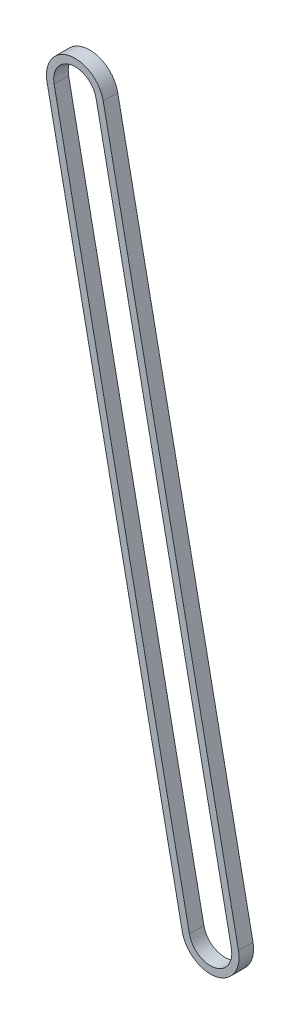
ISO-10303-21;
HEADER;
FILE_DESCRIPTION(('STEP AP214'),'2;1');
FILE_NAME('part.step','',(''),(''),'','','');
FILE_SCHEMA(('AUTOMOTIVE_DESIGN { 1 0 10303 214 1 1 1 1 }'));
ENDSEC;
DATA;
#1=APPLICATION_CONTEXT('core data for automotive mechanical design processes');
#2=APPLICATION_PROTOCOL_DEFINITION('international standard','automotive_design',2000,#1);
#3=PRODUCT_CONTEXT('',#1,'mechanical');
#4=PRODUCT('Part','Part','',(#3));
#5=PRODUCT_RELATED_PRODUCT_CATEGORY('part','',(#4));
#6=PRODUCT_DEFINITION_FORMATION('','',#4);
#7=PRODUCT_DEFINITION_CONTEXT('part definition',#1,'design');
#8=PRODUCT_DEFINITION('design','',#6,#7);
#9=PRODUCT_DEFINITION_SHAPE('','',#8);
#10=(LENGTH_UNIT() NAMED_UNIT(*) SI_UNIT(.MILLI.,.METRE.));
#11=(NAMED_UNIT(*) PLANE_ANGLE_UNIT() SI_UNIT($,.RADIAN.));
#12=(NAMED_UNIT(*) SI_UNIT($,.STERADIAN.) SOLID_ANGLE_UNIT());
#13=UNCERTAINTY_MEASURE_WITH_UNIT(LENGTH_MEASURE(1.E-05),#10,'distance_accuracy_value','');
#14=(GEOMETRIC_REPRESENTATION_CONTEXT(3) GLOBAL_UNCERTAINTY_ASSIGNED_CONTEXT((#13)) GLOBAL_UNIT_ASSIGNED_CONTEXT((#10,
#11,#12)) REPRESENTATION_CONTEXT('',''));
#15=CARTESIAN_POINT('',(0.,0.,0.));
#16=DIRECTION('',(0.,0.,1.));
#17=DIRECTION('',(1.,0.,0.));
#18=AXIS2_PLACEMENT_3D('',#15,#16,#17);
#19=CARTESIAN_POINT('',(0.,0.,4.));
#20=DIRECTION('',(0.,0.,-1.));
#21=DIRECTION('',(-1.,0.,0.));
#22=AXIS2_PLACEMENT_3D('',#19,#20,#21);
#23=CYLINDRICAL_SURFACE('',#22,7.9);
#24=CARTESIAN_POINT('',(0.,0.,0.));
#25=DIRECTION('',(0.,0.,1.));
#26=DIRECTION('',(1.,0.,0.));
#27=AXIS2_PLACEMENT_3D('',#24,#25,#26);
#28=CIRCLE('',#27,7.9);
#29=CARTESIAN_POINT('',(7.74297477721074,1.5672720247227,0.));
#30=VERTEX_POINT('',#29);
#31=CARTESIAN_POINT('',(-7.74297477721074,-1.56727202472271,0.));
#32=VERTEX_POINT('',#31);
#33=EDGE_CURVE('E132',#30,#32,#28,.T.);
#34=ORIENTED_EDGE('',*,*,#33,.T.);
#35=DIRECTION('',(0.,0.,-1.));
#36=VECTOR('',#35,1.);
#37=CARTESIAN_POINT('',(-7.74297477721074,-1.56727202472271,4.));
#38=LINE('',#37,#36);
#39=CARTESIAN_POINT('',(-7.74297477721074,-1.56727202472271,4.));
#40=VERTEX_POINT('',#39);
#41=EDGE_CURVE('E11',#40,#32,#38,.T.);
#42=ORIENTED_EDGE('',*,*,#41,.F.);
#43=CARTESIAN_POINT('',(0.,0.,4.));
#44=DIRECTION('',(0.,0.,1.));
#45=DIRECTION('',(1.,0.,0.));
#46=AXIS2_PLACEMENT_3D('',#43,#44,#45);
#47=CIRCLE('',#46,7.9);
#48=CARTESIAN_POINT('',(7.74297477721074,1.5672720247227,4.));
#49=VERTEX_POINT('',#48);
#50=EDGE_CURVE('E136',#49,#40,#47,.T.);
#51=ORIENTED_EDGE('',*,*,#50,.F.);
#52=DIRECTION('',(0.,0.,-1.));
#53=VECTOR('',#52,1.);
#54=CARTESIAN_POINT('',(7.74297477721074,1.5672720247227,4.));
#55=LINE('',#54,#53);
#56=EDGE_CURVE('E146',#49,#30,#55,.T.);
#57=ORIENTED_EDGE('',*,*,#56,.T.);
#58=EDGE_LOOP('',(#34,#42,#51,#57));
#59=FACE_BOUND('',#58,.T.);
#60=ADVANCED_FACE('F35',(#59),#23,.T.);
#61=CARTESIAN_POINT('',(-7.74297477721074,-1.56727202472271,4.));
#62=DIRECTION('',(0.980123389520346,0.19838886388895,0.));
#63=DIRECTION('',(-0.19838886388895,0.980123389520346,0.));
#64=AXIS2_PLACEMENT_3D('',#61,#62,#63);
#65=PLANE('',#64);
#66=DIRECTION('',(0.19838886388895,-0.980123389520346,0.));
#67=VECTOR('',#66,1.);
#68=CARTESIAN_POINT('',(-7.74297477721074,-1.56727202472271,0.));
#69=LINE('',#68,#67);
#70=CARTESIAN_POINT('',(29.5030484530667,-185.578097123492,0.));
#71=VERTEX_POINT('',#70);
#72=EDGE_CURVE('E149',#32,#71,#69,.T.);
#73=ORIENTED_EDGE('',*,*,#72,.T.);
#74=DIRECTION('',(0.,0.,-1.));
#75=VECTOR('',#74,1.);
#76=CARTESIAN_POINT('',(29.5030484530667,-185.578097123492,4.));
#77=LINE('',#76,#75);
#78=CARTESIAN_POINT('',(29.5030484530667,-185.578097123492,4.));
#79=VERTEX_POINT('',#78);
#80=EDGE_CURVE('E42',#79,#71,#77,.T.);
#81=ORIENTED_EDGE('',*,*,#80,.F.);
#82=DIRECTION('',(0.19838886388895,-0.980123389520346,0.));
#83=VECTOR('',#82,1.);
#84=CARTESIAN_POINT('',(-7.74297477721074,-1.56727202472271,4.));
#85=LINE('',#84,#83);
#86=EDGE_CURVE('E139',#40,#79,#85,.T.);
#87=ORIENTED_EDGE('',*,*,#86,.F.);
#88=ORIENTED_EDGE('',*,*,#41,.T.);
#89=EDGE_LOOP('',(#73,#81,#87,#88));
#90=FACE_BOUND('',#89,.T.);
#91=ADVANCED_FACE('F177',(#90),#65,.F.);
#92=CARTESIAN_POINT('',(37.2460232302775,-184.010825098769,4.));
#93=DIRECTION('',(0.,0.,-1.));
#94=DIRECTION('',(-1.,0.,0.));
#95=AXIS2_PLACEMENT_3D('',#92,#93,#94);
#96=CYLINDRICAL_SURFACE('',#95,7.90000000000001);
#97=CARTESIAN_POINT('',(37.2460232302775,-184.010825098769,0.));
#98=DIRECTION('',(0.,0.,1.));
#99=DIRECTION('',(1.,0.,0.));
#100=AXIS2_PLACEMENT_3D('',#97,#98,#99);
#101=CIRCLE('',#100,7.90000000000001);
#102=CARTESIAN_POINT('',(44.9889980074882,-182.443553074046,0.));
#103=VERTEX_POINT('',#102);
#104=EDGE_CURVE('E151',#71,#103,#101,.T.);
#105=ORIENTED_EDGE('',*,*,#104,.T.);
#106=DIRECTION('',(0.,0.,-1.));
#107=VECTOR('',#106,1.);
#108=CARTESIAN_POINT('',(44.9889980074882,-182.443553074046,4.));
#109=LINE('',#108,#107);
#110=CARTESIAN_POINT('',(44.9889980074882,-182.443553074046,4.));
#111=VERTEX_POINT('',#110);
#112=EDGE_CURVE('E156',#111,#103,#109,.T.);
#113=ORIENTED_EDGE('',*,*,#112,.F.);
#114=CARTESIAN_POINT('',(37.2460232302775,-184.010825098769,4.));
#115=DIRECTION('',(0.,0.,1.));
#116=DIRECTION('',(1.,0.,0.));
#117=AXIS2_PLACEMENT_3D('',#114,#115,#116);
#118=CIRCLE('',#117,7.90000000000001);
#119=EDGE_CURVE('E142',#79,#111,#118,.T.);
#120=ORIENTED_EDGE('',*,*,#119,.F.);
#121=ORIENTED_EDGE('',*,*,#80,.T.);
#122=EDGE_LOOP('',(#105,#113,#120,#121));
#123=FACE_BOUND('',#122,.T.);
#124=ADVANCED_FACE('F163',(#123),#96,.T.);
#125=CARTESIAN_POINT('',(44.9889980074882,-182.443553074046,4.));
#126=DIRECTION('',(-0.980123389520346,-0.19838886388895,0.));
#127=DIRECTION('',(0.19838886388895,-0.980123389520346,0.));
#128=AXIS2_PLACEMENT_3D('',#125,#126,#127);
#129=PLANE('',#128);
#130=DIRECTION('',(-0.19838886388895,0.980123389520346,0.));
#131=VECTOR('',#130,1.);
#132=CARTESIAN_POINT('',(44.9889980074882,-182.443553074046,0.));
#133=LINE('',#132,#131);
#134=EDGE_CURVE('E140',#103,#30,#133,.T.);
#135=ORIENTED_EDGE('',*,*,#134,.T.);
#136=ORIENTED_EDGE('',*,*,#56,.F.);
#137=DIRECTION('',(-0.19838886388895,0.980123389520346,0.));
#138=VECTOR('',#137,1.);
#139=CARTESIAN_POINT('',(44.9889980074882,-182.443553074046,4.));
#140=LINE('',#139,#138);
#141=EDGE_CURVE('E144',#111,#49,#140,.T.);
#142=ORIENTED_EDGE('',*,*,#141,.F.);
#143=ORIENTED_EDGE('',*,*,#112,.T.);
#144=EDGE_LOOP('',(#135,#136,#142,#143));
#145=FACE_BOUND('',#144,.T.);
#146=ADVANCED_FACE('F170',(#145),#129,.F.);
#147=CARTESIAN_POINT('',(0.,0.,4.));
#148=DIRECTION('',(0.,0.,1.));
#149=DIRECTION('',(1.,0.,0.));
#150=AXIS2_PLACEMENT_3D('',#147,#148,#149);
#151=PLANE('',#150);
#152=CARTESIAN_POINT('',(37.2460232302775,-184.010825098769,4.));
#153=DIRECTION('',(0.,0.,1.));
#154=DIRECTION('',(1.,0.,0.));
#155=AXIS2_PLACEMENT_3D('',#152,#153,#154);
#156=CIRCLE('',#155,5.90000000000001);
#157=CARTESIAN_POINT('',(31.4632952321074,-185.181319395714,4.));
#158=VERTEX_POINT('',#157);
#159=CARTESIAN_POINT('',(43.0287512284475,-182.840330801824,4.));
#160=VERTEX_POINT('',#159);
#161=EDGE_CURVE('E49',#158,#160,#156,.T.);
#162=ORIENTED_EDGE('',*,*,#161,.F.);
#163=DIRECTION('',(0.19838886388895,-0.980123389520346,0.));
#164=VECTOR('',#163,1.);
#165=CARTESIAN_POINT('',(-5.78272799817004,-1.17049429694481,4.));
#166=LINE('',#165,#164);
#167=CARTESIAN_POINT('',(-5.78272799817004,-1.17049429694481,4.));
#168=VERTEX_POINT('',#167);
#169=EDGE_CURVE('E117',#168,#158,#166,.T.);
#170=ORIENTED_EDGE('',*,*,#169,.F.);
#171=CARTESIAN_POINT('',(0.,0.,4.));
#172=DIRECTION('',(0.,0.,1.));
#173=DIRECTION('',(1.,0.,0.));
#174=AXIS2_PLACEMENT_3D('',#171,#172,#173);
#175=CIRCLE('',#174,5.9);
#176=CARTESIAN_POINT('',(5.78272799817004,1.17049429694482,4.));
#177=VERTEX_POINT('',#176);
#178=EDGE_CURVE('E120',#177,#168,#175,.T.);
#179=ORIENTED_EDGE('',*,*,#178,.F.);
#180=DIRECTION('',(-0.19838886388895,0.980123389520346,0.));
#181=VECTOR('',#180,1.);
#182=CARTESIAN_POINT('',(43.0287512284475,-182.840330801824,4.));
#183=LINE('',#182,#181);
#184=EDGE_CURVE('E126',#160,#177,#183,.T.);
#185=ORIENTED_EDGE('',*,*,#184,.F.);
#186=EDGE_LOOP('',(#162,#170,#179,#185));
#187=FACE_BOUND('',#186,.T.);
#188=ORIENTED_EDGE('',*,*,#50,.T.);
#189=ORIENTED_EDGE('',*,*,#86,.T.);
#190=ORIENTED_EDGE('',*,*,#119,.T.);
#191=ORIENTED_EDGE('',*,*,#141,.T.);
#192=EDGE_LOOP('',(#188,#189,#190,#191));
#193=FACE_BOUND('',#192,.T.);
#194=ADVANCED_FACE('F176',(#187,#193),#151,.T.);
#195=CARTESIAN_POINT('',(0.,0.,0.));
#196=DIRECTION('',(0.,0.,1.));
#197=DIRECTION('',(1.,0.,0.));
#198=AXIS2_PLACEMENT_3D('',#195,#196,#197);
#199=PLANE('',#198);
#200=DIRECTION('',(0.19838886388895,-0.980123389520346,0.));
#201=VECTOR('',#200,1.);
#202=CARTESIAN_POINT('',(-5.78272799817004,-1.17049429694481,0.));
#203=LINE('',#202,#201);
#204=CARTESIAN_POINT('',(-5.78272799817004,-1.17049429694481,0.));
#205=VERTEX_POINT('',#204);
#206=CARTESIAN_POINT('',(31.4632952321074,-185.181319395714,0.));
#207=VERTEX_POINT('',#206);
#208=EDGE_CURVE('E107',#205,#207,#203,.T.);
#209=ORIENTED_EDGE('',*,*,#208,.T.);
#210=CARTESIAN_POINT('',(37.2460232302775,-184.010825098769,0.));
#211=DIRECTION('',(0.,0.,1.));
#212=DIRECTION('',(1.,0.,0.));
#213=AXIS2_PLACEMENT_3D('',#210,#211,#212);
#214=CIRCLE('',#213,5.90000000000001);
#215=CARTESIAN_POINT('',(43.0287512284475,-182.840330801824,0.));
#216=VERTEX_POINT('',#215);
#217=EDGE_CURVE('E101',#207,#216,#214,.T.);
#218=ORIENTED_EDGE('',*,*,#217,.T.);
#219=DIRECTION('',(-0.19838886388895,0.980123389520346,0.));
#220=VECTOR('',#219,1.);
#221=CARTESIAN_POINT('',(43.0287512284475,-182.840330801824,0.));
#222=LINE('',#221,#220);
#223=CARTESIAN_POINT('',(5.78272799817003,1.17049429694482,0.));
#224=VERTEX_POINT('',#223);
#225=EDGE_CURVE('E110',#216,#224,#222,.T.);
#226=ORIENTED_EDGE('',*,*,#225,.T.);
#227=CARTESIAN_POINT('',(0.,0.,0.));
#228=DIRECTION('',(0.,0.,1.));
#229=DIRECTION('',(1.,0.,0.));
#230=AXIS2_PLACEMENT_3D('',#227,#228,#229);
#231=CIRCLE('',#230,5.9);
#232=EDGE_CURVE('E57',#224,#205,#231,.T.);
#233=ORIENTED_EDGE('',*,*,#232,.T.);
#234=EDGE_LOOP('',(#209,#218,#226,#233));
#235=FACE_BOUND('',#234,.T.);
#236=ORIENTED_EDGE('',*,*,#33,.F.);
#237=ORIENTED_EDGE('',*,*,#134,.F.);
#238=ORIENTED_EDGE('',*,*,#104,.F.);
#239=ORIENTED_EDGE('',*,*,#72,.F.);
#240=EDGE_LOOP('',(#236,#237,#238,#239));
#241=FACE_BOUND('',#240,.T.);
#242=ADVANCED_FACE('F114',(#235,#241),#199,.F.);
#243=CARTESIAN_POINT('',(37.2460232302775,-184.010825098769,0.));
#244=DIRECTION('',(0.,0.,1.));
#245=DIRECTION('',(1.,0.,0.));
#246=AXIS2_PLACEMENT_3D('',#243,#244,#245);
#247=CYLINDRICAL_SURFACE('',#246,5.90000000000001);
#248=ORIENTED_EDGE('',*,*,#161,.T.);
#249=DIRECTION('',(0.,0.,1.));
#250=VECTOR('',#249,1.);
#251=CARTESIAN_POINT('',(43.0287512284475,-182.840330801824,0.));
#252=LINE('',#251,#250);
#253=EDGE_CURVE('E97',#216,#160,#252,.T.);
#254=ORIENTED_EDGE('',*,*,#253,.F.);
#255=ORIENTED_EDGE('',*,*,#217,.F.);
#256=DIRECTION('',(0.,0.,1.));
#257=VECTOR('',#256,1.);
#258=CARTESIAN_POINT('',(31.4632952321074,-185.181319395714,0.));
#259=LINE('',#258,#257);
#260=EDGE_CURVE('E130',#207,#158,#259,.T.);
#261=ORIENTED_EDGE('',*,*,#260,.T.);
#262=EDGE_LOOP('',(#248,#254,#255,#261));
#263=FACE_BOUND('',#262,.T.);
#264=ADVANCED_FACE('F99',(#263),#247,.F.);
#265=CARTESIAN_POINT('',(-5.78272799817004,-1.17049429694481,0.));
#266=DIRECTION('',(-0.980123389520346,-0.19838886388895,0.));
#267=DIRECTION('',(0.19838886388895,-0.980123389520346,0.));
#268=AXIS2_PLACEMENT_3D('',#265,#266,#267);
#269=PLANE('',#268);
#270=ORIENTED_EDGE('',*,*,#169,.T.);
#271=ORIENTED_EDGE('',*,*,#260,.F.);
#272=ORIENTED_EDGE('',*,*,#208,.F.);
#273=DIRECTION('',(0.,0.,1.));
#274=VECTOR('',#273,1.);
#275=CARTESIAN_POINT('',(-5.78272799817004,-1.17049429694481,0.));
#276=LINE('',#275,#274);
#277=EDGE_CURVE('E133',#205,#168,#276,.T.);
#278=ORIENTED_EDGE('',*,*,#277,.T.);
#279=EDGE_LOOP('',(#270,#271,#272,#278));
#280=FACE_BOUND('',#279,.T.);
#281=ADVANCED_FACE('F194',(#280),#269,.F.);
#282=CARTESIAN_POINT('',(0.,0.,0.));
#283=DIRECTION('',(0.,0.,1.));
#284=DIRECTION('',(1.,0.,0.));
#285=AXIS2_PLACEMENT_3D('',#282,#283,#284);
#286=CYLINDRICAL_SURFACE('',#285,5.9);
#287=ORIENTED_EDGE('',*,*,#178,.T.);
#288=ORIENTED_EDGE('',*,*,#277,.F.);
#289=ORIENTED_EDGE('',*,*,#232,.F.);
#290=DIRECTION('',(0.,0.,1.));
#291=VECTOR('',#290,1.);
#292=CARTESIAN_POINT('',(5.78272799817004,1.17049429694482,0.));
#293=LINE('',#292,#291);
#294=EDGE_CURVE('E106',#224,#177,#293,.T.);
#295=ORIENTED_EDGE('',*,*,#294,.T.);
#296=EDGE_LOOP('',(#287,#288,#289,#295));
#297=FACE_BOUND('',#296,.T.);
#298=ADVANCED_FACE('F197',(#297),#286,.F.);
#299=CARTESIAN_POINT('',(43.0287512284475,-182.840330801824,0.));
#300=DIRECTION('',(0.980123389520346,0.19838886388895,0.));
#301=DIRECTION('',(-0.19838886388895,0.980123389520346,0.));
#302=AXIS2_PLACEMENT_3D('',#299,#300,#301);
#303=PLANE('',#302);
#304=ORIENTED_EDGE('',*,*,#184,.T.);
#305=ORIENTED_EDGE('',*,*,#294,.F.);
#306=ORIENTED_EDGE('',*,*,#225,.F.);
#307=ORIENTED_EDGE('',*,*,#253,.T.);
#308=EDGE_LOOP('',(#304,#305,#306,#307));
#309=FACE_BOUND('',#308,.T.);
#310=ADVANCED_FACE('F111',(#309),#303,.F.);
#311=CLOSED_SHELL('',(#60,#91,#124,#146,#194,#242,#264,#281,#298,#310));
#312=MANIFOLD_SOLID_BREP('B2',#311);
#313=ADVANCED_BREP_SHAPE_REPRESENTATION('',(#18,#312),#14);
#314=SHAPE_DEFINITION_REPRESENTATION(#9,#313);
ENDSEC;
END-ISO-10303-21;
